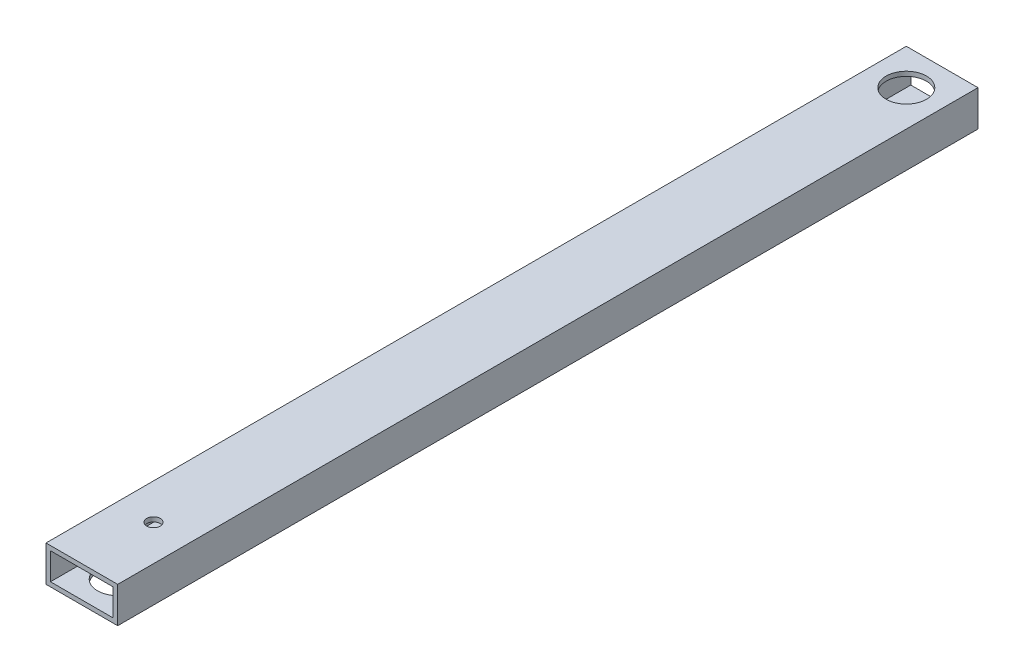
ISO-10303-21;
HEADER;
FILE_DESCRIPTION(('STEP AP214'),'2;1');
FILE_NAME('part.step','',(''),(''),'','','');
FILE_SCHEMA(('AUTOMOTIVE_DESIGN { 1 0 10303 214 1 1 1 1 }'));
ENDSEC;
DATA;
#1=APPLICATION_CONTEXT('core data for automotive mechanical design processes');
#2=APPLICATION_PROTOCOL_DEFINITION('international standard','automotive_design',2000,#1);
#3=PRODUCT_CONTEXT('',#1,'mechanical');
#4=PRODUCT('Part','Part','',(#3));
#5=PRODUCT_RELATED_PRODUCT_CATEGORY('part','',(#4));
#6=PRODUCT_DEFINITION_FORMATION('','',#4);
#7=PRODUCT_DEFINITION_CONTEXT('part definition',#1,'design');
#8=PRODUCT_DEFINITION('design','',#6,#7);
#9=PRODUCT_DEFINITION_SHAPE('','',#8);
#10=(LENGTH_UNIT() NAMED_UNIT(*) SI_UNIT(.MILLI.,.METRE.));
#11=(NAMED_UNIT(*) PLANE_ANGLE_UNIT() SI_UNIT($,.RADIAN.));
#12=(NAMED_UNIT(*) SI_UNIT($,.STERADIAN.) SOLID_ANGLE_UNIT());
#13=UNCERTAINTY_MEASURE_WITH_UNIT(LENGTH_MEASURE(1.E-05),#10,'distance_accuracy_value','');
#14=(GEOMETRIC_REPRESENTATION_CONTEXT(3) GLOBAL_UNCERTAINTY_ASSIGNED_CONTEXT((#13)) GLOBAL_UNIT_ASSIGNED_CONTEXT((#10,
#11,#12)) REPRESENTATION_CONTEXT('',''));
#15=CARTESIAN_POINT('',(0.,0.,0.));
#16=DIRECTION('',(0.,0.,1.));
#17=DIRECTION('',(1.,0.,0.));
#18=AXIS2_PLACEMENT_3D('',#15,#16,#17);
#19=CARTESIAN_POINT('',(0.,0.,609.6));
#20=DIRECTION('',(1.,0.,0.));
#21=DIRECTION('',(0.,0.,-1.));
#22=AXIS2_PLACEMENT_3D('',#19,#20,#21);
#23=PLANE('',#22);
#24=DIRECTION('',(0.,-1.,0.));
#25=VECTOR('',#24,1.);
#26=CARTESIAN_POINT('',(0.,0.,0.));
#27=LINE('',#26,#25);
#28=CARTESIAN_POINT('',(0.,25.4,0.));
#29=VERTEX_POINT('',#28);
#30=CARTESIAN_POINT('',(0.,0.,0.));
#31=VERTEX_POINT('',#30);
#32=EDGE_CURVE('E136',#29,#31,#27,.T.);
#33=ORIENTED_EDGE('',*,*,#32,.T.);
#34=DIRECTION('',(0.,0.,-1.));
#35=VECTOR('',#34,1.);
#36=CARTESIAN_POINT('',(0.,0.,609.6));
#37=LINE('',#36,#35);
#38=CARTESIAN_POINT('',(0.,0.,609.6));
#39=VERTEX_POINT('',#38);
#40=EDGE_CURVE('E11',#39,#31,#37,.T.);
#41=ORIENTED_EDGE('',*,*,#40,.F.);
#42=DIRECTION('',(0.,-1.,0.));
#43=VECTOR('',#42,1.);
#44=CARTESIAN_POINT('',(0.,0.,609.6));
#45=LINE('',#44,#43);
#46=CARTESIAN_POINT('',(0.,25.4,609.6));
#47=VERTEX_POINT('',#46);
#48=EDGE_CURVE('E137',#47,#39,#45,.T.);
#49=ORIENTED_EDGE('',*,*,#48,.F.);
#50=DIRECTION('',(0.,0.,-1.));
#51=VECTOR('',#50,1.);
#52=CARTESIAN_POINT('',(0.,25.4,609.6));
#53=LINE('',#52,#51);
#54=EDGE_CURVE('E147',#47,#29,#53,.T.);
#55=ORIENTED_EDGE('',*,*,#54,.T.);
#56=EDGE_LOOP('',(#33,#41,#49,#55));
#57=FACE_BOUND('',#56,.T.);
#58=ADVANCED_FACE('F33',(#57),#23,.F.);
#59=CARTESIAN_POINT('',(0.,0.,609.6));
#60=DIRECTION('',(0.,1.,0.));
#61=DIRECTION('',(0.,0.,1.));
#62=AXIS2_PLACEMENT_3D('',#59,#60,#61);
#63=PLANE('',#62);
#64=CARTESIAN_POINT('',(25.4,0.,558.8));
#65=DIRECTION('',(0.,1.,0.));
#66=DIRECTION('',(0.,0.,1.));
#67=AXIS2_PLACEMENT_3D('',#64,#65,#66);
#68=CIRCLE('',#67,4.76250000000002);
#69=CARTESIAN_POINT('',(25.4,0.,563.5625));
#70=VERTEX_POINT('',#69);
#71=EDGE_CURVE('E189',#70,#70,#68,.T.);
#72=ORIENTED_EDGE('',*,*,#71,.T.);
#73=EDGE_LOOP('',(#72));
#74=FACE_BOUND('',#73,.T.);
#75=CARTESIAN_POINT('',(25.4,0.,584.2));
#76=DIRECTION('',(0.,-1.,0.));
#77=DIRECTION('',(0.,0.,-1.));
#78=AXIS2_PLACEMENT_3D('',#75,#76,#77);
#79=CIRCLE('',#78,14.2875);
#80=CARTESIAN_POINT('',(25.4,0.,569.9125));
#81=VERTEX_POINT('',#80);
#82=EDGE_CURVE('E178',#81,#81,#79,.T.);
#83=ORIENTED_EDGE('',*,*,#82,.F.);
#84=EDGE_LOOP('',(#83));
#85=FACE_BOUND('',#84,.T.);
#86=CARTESIAN_POINT('',(25.4,0.,25.4));
#87=DIRECTION('',(0.,1.,0.));
#88=DIRECTION('',(0.,0.,1.));
#89=AXIS2_PLACEMENT_3D('',#86,#87,#88);
#90=CIRCLE('',#89,14.2875);
#91=CARTESIAN_POINT('',(25.4,0.,39.6875));
#92=VERTEX_POINT('',#91);
#93=EDGE_CURVE('E164',#92,#92,#90,.T.);
#94=ORIENTED_EDGE('',*,*,#93,.T.);
#95=EDGE_LOOP('',(#94));
#96=FACE_BOUND('',#95,.T.);
#97=DIRECTION('',(1.,0.,0.));
#98=VECTOR('',#97,1.);
#99=CARTESIAN_POINT('',(0.,0.,0.));
#100=LINE('',#99,#98);
#101=CARTESIAN_POINT('',(50.8,0.,0.));
#102=VERTEX_POINT('',#101);
#103=EDGE_CURVE('E150',#31,#102,#100,.T.);
#104=ORIENTED_EDGE('',*,*,#103,.T.);
#105=DIRECTION('',(0.,0.,-1.));
#106=VECTOR('',#105,1.);
#107=CARTESIAN_POINT('',(50.8,0.,609.6));
#108=LINE('',#107,#106);
#109=CARTESIAN_POINT('',(50.8,0.,609.6));
#110=VERTEX_POINT('',#109);
#111=EDGE_CURVE('E41',#110,#102,#108,.T.);
#112=ORIENTED_EDGE('',*,*,#111,.F.);
#113=DIRECTION('',(1.,0.,0.));
#114=VECTOR('',#113,1.);
#115=CARTESIAN_POINT('',(0.,0.,609.6));
#116=LINE('',#115,#114);
#117=EDGE_CURVE('E140',#39,#110,#116,.T.);
#118=ORIENTED_EDGE('',*,*,#117,.F.);
#119=ORIENTED_EDGE('',*,*,#40,.T.);
#120=EDGE_LOOP('',(#104,#112,#118,#119));
#121=FACE_BOUND('',#120,.T.);
#122=ADVANCED_FACE('F212',(#74,#85,#96,#121),#63,.F.);
#123=CARTESIAN_POINT('',(50.8,0.,609.6));
#124=DIRECTION('',(-1.,0.,0.));
#125=DIRECTION('',(0.,0.,1.));
#126=AXIS2_PLACEMENT_3D('',#123,#124,#125);
#127=PLANE('',#126);
#128=DIRECTION('',(0.,1.,0.));
#129=VECTOR('',#128,1.);
#130=CARTESIAN_POINT('',(50.8,0.,0.));
#131=LINE('',#130,#129);
#132=CARTESIAN_POINT('',(50.8,25.4,0.));
#133=VERTEX_POINT('',#132);
#134=EDGE_CURVE('E152',#102,#133,#131,.T.);
#135=ORIENTED_EDGE('',*,*,#134,.T.);
#136=DIRECTION('',(0.,0.,-1.));
#137=VECTOR('',#136,1.);
#138=CARTESIAN_POINT('',(50.8,25.4,609.6));
#139=LINE('',#138,#137);
#140=CARTESIAN_POINT('',(50.8,25.4,609.6));
#141=VERTEX_POINT('',#140);
#142=EDGE_CURVE('E157',#141,#133,#139,.T.);
#143=ORIENTED_EDGE('',*,*,#142,.F.);
#144=DIRECTION('',(0.,1.,0.));
#145=VECTOR('',#144,1.);
#146=CARTESIAN_POINT('',(50.8,0.,609.6));
#147=LINE('',#146,#145);
#148=EDGE_CURVE('E143',#110,#141,#147,.T.);
#149=ORIENTED_EDGE('',*,*,#148,.F.);
#150=ORIENTED_EDGE('',*,*,#111,.T.);
#151=EDGE_LOOP('',(#135,#143,#149,#150));
#152=FACE_BOUND('',#151,.T.);
#153=ADVANCED_FACE('F217',(#152),#127,.F.);
#154=CARTESIAN_POINT('',(0.,25.4,609.6));
#155=DIRECTION('',(0.,-1.,0.));
#156=DIRECTION('',(0.,0.,-1.));
#157=AXIS2_PLACEMENT_3D('',#154,#155,#156);
#158=PLANE('',#157);
#159=CARTESIAN_POINT('',(25.4,25.4,558.8));
#160=DIRECTION('',(0.,1.,0.));
#161=DIRECTION('',(0.,0.,1.));
#162=AXIS2_PLACEMENT_3D('',#159,#160,#161);
#163=CIRCLE('',#162,4.76250000000002);
#164=CARTESIAN_POINT('',(25.4,25.4,563.5625));
#165=VERTEX_POINT('',#164);
#166=EDGE_CURVE('E186',#165,#165,#163,.T.);
#167=ORIENTED_EDGE('',*,*,#166,.F.);
#168=EDGE_LOOP('',(#167));
#169=FACE_BOUND('',#168,.T.);
#170=CARTESIAN_POINT('',(25.4,25.4,25.4));
#171=DIRECTION('',(0.,1.,0.));
#172=DIRECTION('',(0.,0.,1.));
#173=AXIS2_PLACEMENT_3D('',#170,#171,#172);
#174=CIRCLE('',#173,14.2875);
#175=CARTESIAN_POINT('',(25.4,25.4,39.6875));
#176=VERTEX_POINT('',#175);
#177=EDGE_CURVE('E170',#176,#176,#174,.T.);
#178=ORIENTED_EDGE('',*,*,#177,.F.);
#179=EDGE_LOOP('',(#178));
#180=FACE_BOUND('',#179,.T.);
#181=DIRECTION('',(-1.,0.,0.));
#182=VECTOR('',#181,1.);
#183=CARTESIAN_POINT('',(0.,25.4,0.));
#184=LINE('',#183,#182);
#185=EDGE_CURVE('E141',#133,#29,#184,.T.);
#186=ORIENTED_EDGE('',*,*,#185,.T.);
#187=ORIENTED_EDGE('',*,*,#54,.F.);
#188=DIRECTION('',(-1.,0.,0.));
#189=VECTOR('',#188,1.);
#190=CARTESIAN_POINT('',(0.,25.4,609.6));
#191=LINE('',#190,#189);
#192=EDGE_CURVE('E145',#141,#47,#191,.T.);
#193=ORIENTED_EDGE('',*,*,#192,.F.);
#194=ORIENTED_EDGE('',*,*,#142,.T.);
#195=EDGE_LOOP('',(#186,#187,#193,#194));
#196=FACE_BOUND('',#195,.T.);
#197=ADVANCED_FACE('F232',(#169,#180,#196),#158,.F.);
#198=CARTESIAN_POINT('',(0.,0.,609.6));
#199=DIRECTION('',(0.,0.,-1.));
#200=DIRECTION('',(-1.,0.,0.));
#201=AXIS2_PLACEMENT_3D('',#198,#199,#200);
#202=PLANE('',#201);
#203=DIRECTION('',(-1.,0.,0.));
#204=VECTOR('',#203,1.);
#205=CARTESIAN_POINT('',(0.,3.175,609.6));
#206=LINE('',#205,#204);
#207=CARTESIAN_POINT('',(47.625,3.175,609.6));
#208=VERTEX_POINT('',#207);
#209=CARTESIAN_POINT('',(3.175,3.175,609.6));
#210=VERTEX_POINT('',#209);
#211=EDGE_CURVE('E130',#208,#210,#206,.T.);
#212=ORIENTED_EDGE('',*,*,#211,.T.);
#213=DIRECTION('',(0.,1.,0.));
#214=VECTOR('',#213,1.);
#215=CARTESIAN_POINT('',(3.175,0.,609.6));
#216=LINE('',#215,#214);
#217=CARTESIAN_POINT('',(3.175,22.225,609.6));
#218=VERTEX_POINT('',#217);
#219=EDGE_CURVE('E133',#210,#218,#216,.T.);
#220=ORIENTED_EDGE('',*,*,#219,.T.);
#221=DIRECTION('',(1.,0.,0.));
#222=VECTOR('',#221,1.);
#223=CARTESIAN_POINT('',(0.,22.225,609.6));
#224=LINE('',#223,#222);
#225=CARTESIAN_POINT('',(47.625,22.225,609.6));
#226=VERTEX_POINT('',#225);
#227=EDGE_CURVE('E125',#218,#226,#224,.T.);
#228=ORIENTED_EDGE('',*,*,#227,.T.);
#229=DIRECTION('',(0.,-1.,0.));
#230=VECTOR('',#229,1.);
#231=CARTESIAN_POINT('',(47.625,0.,609.6));
#232=LINE('',#231,#230);
#233=EDGE_CURVE('E105',#226,#208,#232,.T.);
#234=ORIENTED_EDGE('',*,*,#233,.T.);
#235=EDGE_LOOP('',(#212,#220,#228,#234));
#236=FACE_BOUND('',#235,.T.);
#237=ORIENTED_EDGE('',*,*,#48,.T.);
#238=ORIENTED_EDGE('',*,*,#117,.T.);
#239=ORIENTED_EDGE('',*,*,#148,.T.);
#240=ORIENTED_EDGE('',*,*,#192,.T.);
#241=EDGE_LOOP('',(#237,#238,#239,#240));
#242=FACE_BOUND('',#241,.T.);
#243=ADVANCED_FACE('F228',(#236,#242),#202,.F.);
#244=CARTESIAN_POINT('',(0.,0.,0.));
#245=DIRECTION('',(0.,0.,-1.));
#246=DIRECTION('',(-1.,0.,0.));
#247=AXIS2_PLACEMENT_3D('',#244,#245,#246);
#248=PLANE('',#247);
#249=DIRECTION('',(0.,1.,0.));
#250=VECTOR('',#249,1.);
#251=CARTESIAN_POINT('',(3.175,3.175,0.));
#252=LINE('',#251,#250);
#253=CARTESIAN_POINT('',(3.175,3.175,0.));
#254=VERTEX_POINT('',#253);
#255=CARTESIAN_POINT('',(3.175,22.225,0.));
#256=VERTEX_POINT('',#255);
#257=EDGE_CURVE('E57',#254,#256,#252,.T.);
#258=ORIENTED_EDGE('',*,*,#257,.F.);
#259=DIRECTION('',(-1.,0.,0.));
#260=VECTOR('',#259,1.);
#261=CARTESIAN_POINT('',(3.175,3.175,0.));
#262=LINE('',#261,#260);
#263=CARTESIAN_POINT('',(47.625,3.175,0.));
#264=VERTEX_POINT('',#263);
#265=EDGE_CURVE('E118',#264,#254,#262,.T.);
#266=ORIENTED_EDGE('',*,*,#265,.F.);
#267=DIRECTION('',(0.,-1.,0.));
#268=VECTOR('',#267,1.);
#269=CARTESIAN_POINT('',(47.625,3.175,0.));
#270=LINE('',#269,#268);
#271=CARTESIAN_POINT('',(47.625,22.225,0.));
#272=VERTEX_POINT('',#271);
#273=EDGE_CURVE('E102',#272,#264,#270,.T.);
#274=ORIENTED_EDGE('',*,*,#273,.F.);
#275=DIRECTION('',(1.,0.,0.));
#276=VECTOR('',#275,1.);
#277=CARTESIAN_POINT('',(3.175,22.225,0.));
#278=LINE('',#277,#276);
#279=EDGE_CURVE('E111',#256,#272,#278,.T.);
#280=ORIENTED_EDGE('',*,*,#279,.F.);
#281=EDGE_LOOP('',(#258,#266,#274,#280));
#282=FACE_BOUND('',#281,.T.);
#283=ORIENTED_EDGE('',*,*,#32,.F.);
#284=ORIENTED_EDGE('',*,*,#185,.F.);
#285=ORIENTED_EDGE('',*,*,#134,.F.);
#286=ORIENTED_EDGE('',*,*,#103,.F.);
#287=EDGE_LOOP('',(#283,#284,#285,#286));
#288=FACE_BOUND('',#287,.T.);
#289=ADVANCED_FACE('F115',(#282,#288),#248,.T.);
#290=CARTESIAN_POINT('',(3.175,3.175,635.));
#291=DIRECTION('',(-1.,0.,0.));
#292=DIRECTION('',(0.,0.,1.));
#293=AXIS2_PLACEMENT_3D('',#290,#291,#292);
#294=PLANE('',#293);
#295=DIRECTION('',(0.,0.,-1.));
#296=VECTOR('',#295,1.);
#297=CARTESIAN_POINT('',(3.175,3.175,635.));
#298=LINE('',#297,#296);
#299=EDGE_CURVE('E123',#210,#254,#298,.T.);
#300=ORIENTED_EDGE('',*,*,#299,.T.);
#301=ORIENTED_EDGE('',*,*,#257,.T.);
#302=DIRECTION('',(0.,0.,-1.));
#303=VECTOR('',#302,1.);
#304=CARTESIAN_POINT('',(3.175,22.225,635.));
#305=LINE('',#304,#303);
#306=EDGE_CURVE('E108',#218,#256,#305,.T.);
#307=ORIENTED_EDGE('',*,*,#306,.F.);
#308=ORIENTED_EDGE('',*,*,#219,.F.);
#309=EDGE_LOOP('',(#300,#301,#307,#308));
#310=FACE_BOUND('',#309,.T.);
#311=ADVANCED_FACE('F244',(#310),#294,.F.);
#312=CARTESIAN_POINT('',(3.175,3.175,635.));
#313=DIRECTION('',(0.,-1.,0.));
#314=DIRECTION('',(0.,0.,-1.));
#315=AXIS2_PLACEMENT_3D('',#312,#313,#314);
#316=PLANE('',#315);
#317=CARTESIAN_POINT('',(25.4,3.175,558.8));
#318=DIRECTION('',(0.,-1.,0.));
#319=DIRECTION('',(0.,0.,-1.));
#320=AXIS2_PLACEMENT_3D('',#317,#318,#319);
#321=CIRCLE('',#320,4.76250000000002);
#322=CARTESIAN_POINT('',(25.4,3.175,554.0375));
#323=VERTEX_POINT('',#322);
#324=EDGE_CURVE('E181',#323,#323,#321,.T.);
#325=ORIENTED_EDGE('',*,*,#324,.T.);
#326=EDGE_LOOP('',(#325));
#327=FACE_BOUND('',#326,.T.);
#328=CARTESIAN_POINT('',(25.4,3.175,584.2));
#329=DIRECTION('',(0.,-1.,0.));
#330=DIRECTION('',(0.,0.,-1.));
#331=AXIS2_PLACEMENT_3D('',#328,#329,#330);
#332=CIRCLE('',#331,14.2875);
#333=CARTESIAN_POINT('',(25.4,3.175,569.9125));
#334=VERTEX_POINT('',#333);
#335=EDGE_CURVE('E175',#334,#334,#332,.T.);
#336=ORIENTED_EDGE('',*,*,#335,.T.);
#337=EDGE_LOOP('',(#336));
#338=FACE_BOUND('',#337,.T.);
#339=CARTESIAN_POINT('',(25.4,3.175,25.4));
#340=DIRECTION('',(0.,-1.,0.));
#341=DIRECTION('',(0.,0.,-1.));
#342=AXIS2_PLACEMENT_3D('',#339,#340,#341);
#343=CIRCLE('',#342,14.2875);
#344=CARTESIAN_POINT('',(25.4,3.175,11.1125));
#345=VERTEX_POINT('',#344);
#346=EDGE_CURVE('E163',#345,#345,#343,.T.);
#347=ORIENTED_EDGE('',*,*,#346,.T.);
#348=EDGE_LOOP('',(#347));
#349=FACE_BOUND('',#348,.T.);
#350=DIRECTION('',(0.,0.,-1.));
#351=VECTOR('',#350,1.);
#352=CARTESIAN_POINT('',(47.625,3.175,635.));
#353=LINE('',#352,#351);
#354=EDGE_CURVE('E107',#208,#264,#353,.T.);
#355=ORIENTED_EDGE('',*,*,#354,.T.);
#356=ORIENTED_EDGE('',*,*,#265,.T.);
#357=ORIENTED_EDGE('',*,*,#299,.F.);
#358=ORIENTED_EDGE('',*,*,#211,.F.);
#359=EDGE_LOOP('',(#355,#356,#357,#358));
#360=FACE_BOUND('',#359,.T.);
#361=ADVANCED_FACE('F250',(#327,#338,#349,#360),#316,.F.);
#362=CARTESIAN_POINT('',(47.625,3.175,635.));
#363=DIRECTION('',(1.,0.,0.));
#364=DIRECTION('',(0.,0.,-1.));
#365=AXIS2_PLACEMENT_3D('',#362,#363,#364);
#366=PLANE('',#365);
#367=DIRECTION('',(0.,0.,-1.));
#368=VECTOR('',#367,1.);
#369=CARTESIAN_POINT('',(47.625,22.225,635.));
#370=LINE('',#369,#368);
#371=EDGE_CURVE('E49',#226,#272,#370,.T.);
#372=ORIENTED_EDGE('',*,*,#371,.T.);
#373=ORIENTED_EDGE('',*,*,#273,.T.);
#374=ORIENTED_EDGE('',*,*,#354,.F.);
#375=ORIENTED_EDGE('',*,*,#233,.F.);
#376=EDGE_LOOP('',(#372,#373,#374,#375));
#377=FACE_BOUND('',#376,.T.);
#378=ADVANCED_FACE('F99',(#377),#366,.F.);
#379=CARTESIAN_POINT('',(3.175,22.225,635.));
#380=DIRECTION('',(0.,1.,0.));
#381=DIRECTION('',(0.,0.,1.));
#382=AXIS2_PLACEMENT_3D('',#379,#380,#381);
#383=PLANE('',#382);
#384=CARTESIAN_POINT('',(25.4,22.225,558.8));
#385=DIRECTION('',(0.,1.,0.));
#386=DIRECTION('',(0.,0.,1.));
#387=AXIS2_PLACEMENT_3D('',#384,#385,#386);
#388=CIRCLE('',#387,4.76250000000002);
#389=CARTESIAN_POINT('',(25.4,22.225,563.5625));
#390=VERTEX_POINT('',#389);
#391=EDGE_CURVE('E36',#390,#390,#388,.T.);
#392=ORIENTED_EDGE('',*,*,#391,.T.);
#393=EDGE_LOOP('',(#392));
#394=FACE_BOUND('',#393,.T.);
#395=CARTESIAN_POINT('',(25.4,22.225,25.4));
#396=DIRECTION('',(0.,1.,0.));
#397=DIRECTION('',(0.,0.,1.));
#398=AXIS2_PLACEMENT_3D('',#395,#396,#397);
#399=CIRCLE('',#398,14.2875);
#400=CARTESIAN_POINT('',(25.4,22.225,39.6875));
#401=VERTEX_POINT('',#400);
#402=EDGE_CURVE('E161',#401,#401,#399,.T.);
#403=ORIENTED_EDGE('',*,*,#402,.T.);
#404=EDGE_LOOP('',(#403));
#405=FACE_BOUND('',#404,.T.);
#406=ORIENTED_EDGE('',*,*,#306,.T.);
#407=ORIENTED_EDGE('',*,*,#279,.T.);
#408=ORIENTED_EDGE('',*,*,#371,.F.);
#409=ORIENTED_EDGE('',*,*,#227,.F.);
#410=EDGE_LOOP('',(#406,#407,#408,#409));
#411=FACE_BOUND('',#410,.T.);
#412=ADVANCED_FACE('F112',(#394,#405,#411),#383,.F.);
#413=CARTESIAN_POINT('',(25.4,0.,25.4));
#414=DIRECTION('',(0.,1.,0.));
#415=DIRECTION('',(0.,0.,1.));
#416=AXIS2_PLACEMENT_3D('',#413,#414,#415);
#417=CYLINDRICAL_SURFACE('',#416,14.2875);
#418=ORIENTED_EDGE('',*,*,#177,.T.);
#419=EDGE_LOOP('',(#418));
#420=FACE_BOUND('',#419,.T.);
#421=ORIENTED_EDGE('',*,*,#402,.F.);
#422=EDGE_LOOP('',(#421));
#423=FACE_BOUND('',#422,.T.);
#424=ADVANCED_FACE('F253',(#420,#423),#417,.F.);
#425=ORIENTED_EDGE('',*,*,#93,.F.);
#426=EDGE_LOOP('',(#425));
#427=FACE_BOUND('',#426,.T.);
#428=ORIENTED_EDGE('',*,*,#346,.F.);
#429=EDGE_LOOP('',(#428));
#430=FACE_BOUND('',#429,.T.);
#431=ADVANCED_FACE('F208',(#427,#430),#417,.F.);
#432=CARTESIAN_POINT('',(25.4,3.175,584.2));
#433=DIRECTION('',(0.,-1.,0.));
#434=DIRECTION('',(0.,0.,-1.));
#435=AXIS2_PLACEMENT_3D('',#432,#433,#434);
#436=CYLINDRICAL_SURFACE('',#435,14.2875);
#437=ORIENTED_EDGE('',*,*,#335,.F.);
#438=EDGE_LOOP('',(#437));
#439=FACE_BOUND('',#438,.T.);
#440=ORIENTED_EDGE('',*,*,#82,.T.);
#441=EDGE_LOOP('',(#440));
#442=FACE_BOUND('',#441,.T.);
#443=ADVANCED_FACE('F200',(#439,#442),#436,.F.);
#444=CARTESIAN_POINT('',(25.4,0.,558.8));
#445=DIRECTION('',(0.,1.,0.));
#446=DIRECTION('',(0.,0.,1.));
#447=AXIS2_PLACEMENT_3D('',#444,#445,#446);
#448=CYLINDRICAL_SURFACE('',#447,4.76250000000002);
#449=ORIENTED_EDGE('',*,*,#166,.T.);
#450=EDGE_LOOP('',(#449));
#451=FACE_BOUND('',#450,.T.);
#452=ORIENTED_EDGE('',*,*,#391,.F.);
#453=EDGE_LOOP('',(#452));
#454=FACE_BOUND('',#453,.T.);
#455=ADVANCED_FACE('F197',(#451,#454),#448,.F.);
#456=ORIENTED_EDGE('',*,*,#71,.F.);
#457=EDGE_LOOP('',(#456));
#458=FACE_BOUND('',#457,.T.);
#459=ORIENTED_EDGE('',*,*,#324,.F.);
#460=EDGE_LOOP('',(#459));
#461=FACE_BOUND('',#460,.T.);
#462=ADVANCED_FACE('F199',(#458,#461),#448,.F.);
#463=CLOSED_SHELL('',(#58,#122,#153,#197,#243,#289,#311,#361,#378,#412,#424,#431,#443,#455,#462));
#464=MANIFOLD_SOLID_BREP('B2',#463);
#465=ADVANCED_BREP_SHAPE_REPRESENTATION('',(#18,#464),#14);
#466=SHAPE_DEFINITION_REPRESENTATION(#9,#465);
ENDSEC;
END-ISO-10303-21;
